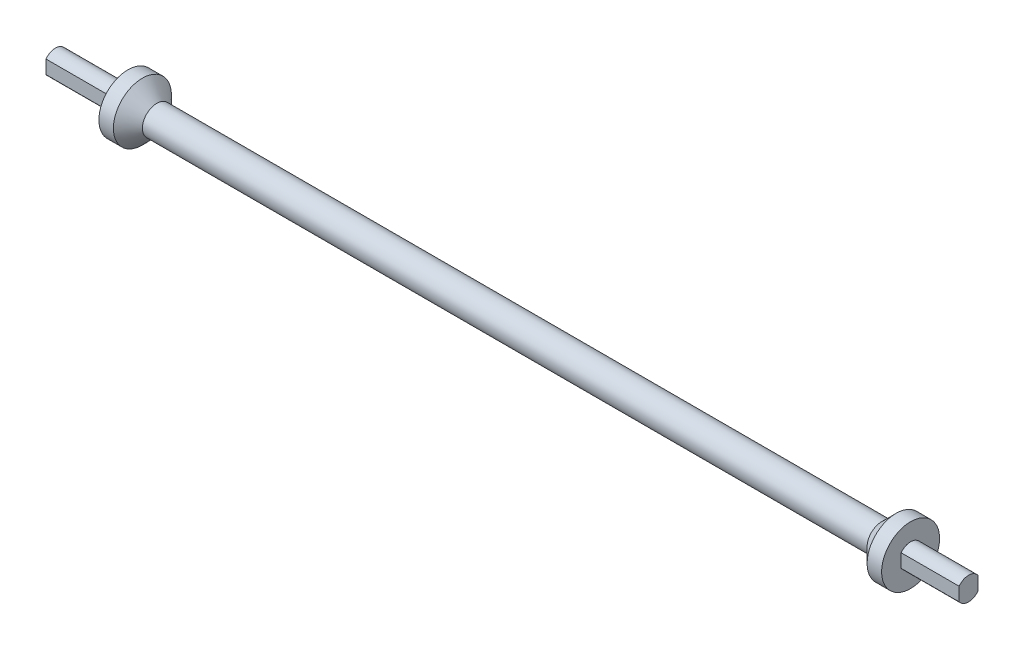
ISO-10303-21;
HEADER;
FILE_DESCRIPTION(('STEP AP214'),'2;1');
FILE_NAME('part.step','',(''),(''),'','','');
FILE_SCHEMA(('AUTOMOTIVE_DESIGN { 1 0 10303 214 1 1 1 1 }'));
ENDSEC;
DATA;
#1=APPLICATION_CONTEXT('core data for automotive mechanical design processes');
#2=APPLICATION_PROTOCOL_DEFINITION('international standard','automotive_design',2000,#1);
#3=PRODUCT_CONTEXT('',#1,'mechanical');
#4=PRODUCT('Part','Part','',(#3));
#5=PRODUCT_RELATED_PRODUCT_CATEGORY('part','',(#4));
#6=PRODUCT_DEFINITION_FORMATION('','',#4);
#7=PRODUCT_DEFINITION_CONTEXT('part definition',#1,'design');
#8=PRODUCT_DEFINITION('design','',#6,#7);
#9=PRODUCT_DEFINITION_SHAPE('','',#8);
#10=(LENGTH_UNIT() NAMED_UNIT(*) SI_UNIT(.MILLI.,.METRE.));
#11=(NAMED_UNIT(*) PLANE_ANGLE_UNIT() SI_UNIT($,.RADIAN.));
#12=(NAMED_UNIT(*) SI_UNIT($,.STERADIAN.) SOLID_ANGLE_UNIT());
#13=UNCERTAINTY_MEASURE_WITH_UNIT(LENGTH_MEASURE(1.E-05),#10,'distance_accuracy_value','');
#14=(GEOMETRIC_REPRESENTATION_CONTEXT(3) GLOBAL_UNCERTAINTY_ASSIGNED_CONTEXT((#13)) GLOBAL_UNIT_ASSIGNED_CONTEXT((#10,
#11,#12)) REPRESENTATION_CONTEXT('',''));
#15=CARTESIAN_POINT('',(0.,0.,0.));
#16=DIRECTION('',(0.,0.,1.));
#17=DIRECTION('',(1.,0.,0.));
#18=AXIS2_PLACEMENT_3D('',#15,#16,#17);
#19=CARTESIAN_POINT('',(-25.3674142888742,0.,0.));
#20=DIRECTION('',(-1.,0.,0.));
#21=DIRECTION('',(0.,0.,1.));
#22=AXIS2_PLACEMENT_3D('',#19,#20,#21);
#23=CYLINDRICAL_SURFACE('',#22,3.99999999999996);
#24=DIRECTION('',(-1.,0.,0.));
#25=VECTOR('',#24,1.);
#26=CARTESIAN_POINT('',(-25.3674142888742,2.33184476327214,3.25));
#27=LINE('',#26,#25);
#28=CARTESIAN_POINT('',(-135.,2.33184476327215,3.25));
#29=VERTEX_POINT('',#28);
#30=CARTESIAN_POINT('',(-160.,2.33184476327214,3.25));
#31=VERTEX_POINT('',#30);
#32=EDGE_CURVE('E49',#29,#31,#27,.T.);
#33=ORIENTED_EDGE('',*,*,#32,.F.);
#34=CARTESIAN_POINT('',(-135.,0.,0.));
#35=DIRECTION('',(-1.,0.,0.));
#36=DIRECTION('',(0.,0.,1.));
#37=AXIS2_PLACEMENT_3D('',#34,#35,#36);
#38=CIRCLE('',#37,3.99999999999997);
#39=CARTESIAN_POINT('',(-135.,2.33184476327214,-3.25));
#40=VERTEX_POINT('',#39);
#41=EDGE_CURVE('E111',#29,#40,#38,.T.);
#42=ORIENTED_EDGE('',*,*,#41,.T.);
#43=DIRECTION('',(-1.,0.,0.));
#44=VECTOR('',#43,1.);
#45=CARTESIAN_POINT('',(-25.3674142888742,2.33184476327214,-3.25));
#46=LINE('',#45,#44);
#47=CARTESIAN_POINT('',(-160.,2.33184476327214,-3.25));
#48=VERTEX_POINT('',#47);
#49=EDGE_CURVE('E187',#48,#40,#46,.F.);
#50=ORIENTED_EDGE('',*,*,#49,.F.);
#51=CARTESIAN_POINT('',(-160.,0.,0.));
#52=DIRECTION('',(1.,0.,0.));
#53=DIRECTION('',(0.,0.,-1.));
#54=AXIS2_PLACEMENT_3D('',#51,#52,#53);
#55=CIRCLE('',#54,3.99999999999996);
#56=EDGE_CURVE('E114',#48,#31,#55,.T.);
#57=ORIENTED_EDGE('',*,*,#56,.T.);
#58=EDGE_LOOP('',(#33,#42,#50,#57));
#59=FACE_BOUND('',#58,.T.);
#60=ADVANCED_FACE('F34',(#59),#23,.T.);
#61=DIRECTION('',(-1.,0.,0.));
#62=VECTOR('',#61,1.);
#63=CARTESIAN_POINT('',(-25.3674142888742,-2.33184476327214,3.25));
#64=LINE('',#63,#62);
#65=CARTESIAN_POINT('',(-160.,-2.33184476327214,3.25));
#66=VERTEX_POINT('',#65);
#67=CARTESIAN_POINT('',(-135.,-2.33184476327215,3.25));
#68=VERTEX_POINT('',#67);
#69=EDGE_CURVE('E101',#66,#68,#64,.F.);
#70=ORIENTED_EDGE('',*,*,#69,.F.);
#71=CARTESIAN_POINT('',(-160.,-2.33184476327214,-3.25));
#72=VERTEX_POINT('',#71);
#73=EDGE_CURVE('E153',#66,#72,#55,.T.);
#74=ORIENTED_EDGE('',*,*,#73,.T.);
#75=DIRECTION('',(-1.,0.,0.));
#76=VECTOR('',#75,1.);
#77=CARTESIAN_POINT('',(-25.3674142888742,-2.33184476327214,-3.25));
#78=LINE('',#77,#76);
#79=CARTESIAN_POINT('',(-135.,-2.33184476327214,-3.25));
#80=VERTEX_POINT('',#79);
#81=EDGE_CURVE('E188',#80,#72,#78,.T.);
#82=ORIENTED_EDGE('',*,*,#81,.F.);
#83=EDGE_CURVE('E121',#80,#68,#38,.T.);
#84=ORIENTED_EDGE('',*,*,#83,.T.);
#85=EDGE_LOOP('',(#70,#74,#82,#84));
#86=FACE_BOUND('',#85,.T.);
#87=ADVANCED_FACE('F195',(#86),#23,.T.);
#88=CARTESIAN_POINT('',(-160.,10.,0.));
#89=DIRECTION('',(1.,0.,0.));
#90=DIRECTION('',(0.,0.,-1.));
#91=AXIS2_PLACEMENT_3D('',#88,#89,#90);
#92=PLANE('',#91);
#93=DIRECTION('',(0.,-1.,0.));
#94=VECTOR('',#93,1.);
#95=CARTESIAN_POINT('',(-160.,10.0000000000001,3.25));
#96=LINE('',#95,#94);
#97=EDGE_CURVE('E106',#31,#66,#96,.T.);
#98=ORIENTED_EDGE('',*,*,#97,.F.);
#99=ORIENTED_EDGE('',*,*,#56,.F.);
#100=DIRECTION('',(0.,1.,0.));
#101=VECTOR('',#100,1.);
#102=CARTESIAN_POINT('',(-160.,10.,-3.25));
#103=LINE('',#102,#101);
#104=EDGE_CURVE('E12',#72,#48,#103,.T.);
#105=ORIENTED_EDGE('',*,*,#104,.F.);
#106=ORIENTED_EDGE('',*,*,#73,.F.);
#107=EDGE_LOOP('',(#98,#99,#105,#106));
#108=FACE_BOUND('',#107,.T.);
#109=ADVANCED_FACE('F197',(#108),#92,.F.);
#110=CARTESIAN_POINT('',(155.,4.,0.));
#111=DIRECTION('',(-1.,0.,0.));
#112=DIRECTION('',(0.,0.,1.));
#113=AXIS2_PLACEMENT_3D('',#110,#111,#112);
#114=PLANE('',#113);
#115=DIRECTION('',(0.,-1.,0.));
#116=VECTOR('',#115,1.);
#117=CARTESIAN_POINT('',(155.,10.0000000000001,3.25));
#118=LINE('',#117,#116);
#119=CARTESIAN_POINT('',(155.,2.33184476327221,3.25));
#120=VERTEX_POINT('',#119);
#121=CARTESIAN_POINT('',(155.,-2.33184476327221,3.25));
#122=VERTEX_POINT('',#121);
#123=EDGE_CURVE('E294',#120,#122,#118,.T.);
#124=ORIENTED_EDGE('',*,*,#123,.T.);
#125=CARTESIAN_POINT('',(155.,0.,0.));
#126=DIRECTION('',(-1.,0.,0.));
#127=DIRECTION('',(0.,0.,1.));
#128=AXIS2_PLACEMENT_3D('',#125,#126,#127);
#129=CIRCLE('',#128,4.);
#130=CARTESIAN_POINT('',(155.,-2.3318447632722,-3.25));
#131=VERTEX_POINT('',#130);
#132=EDGE_CURVE('E122',#131,#122,#129,.T.);
#133=ORIENTED_EDGE('',*,*,#132,.F.);
#134=DIRECTION('',(0.,-1.,0.));
#135=VECTOR('',#134,1.);
#136=CARTESIAN_POINT('',(155.,10.0000000000001,-3.25));
#137=LINE('',#136,#135);
#138=CARTESIAN_POINT('',(155.,2.3318447632722,-3.25));
#139=VERTEX_POINT('',#138);
#140=EDGE_CURVE('E172',#139,#131,#137,.T.);
#141=ORIENTED_EDGE('',*,*,#140,.F.);
#142=EDGE_CURVE('E126',#120,#139,#129,.T.);
#143=ORIENTED_EDGE('',*,*,#142,.F.);
#144=EDGE_LOOP('',(#124,#133,#141,#143));
#145=FACE_BOUND('',#144,.T.);
#146=ADVANCED_FACE('F178',(#145),#114,.F.);
#147=CARTESIAN_POINT('',(-25.3674142888742,0.,0.));
#148=DIRECTION('',(-1.,0.,0.));
#149=DIRECTION('',(0.,0.,1.));
#150=AXIS2_PLACEMENT_3D('',#147,#148,#149);
#151=CYLINDRICAL_SURFACE('',#150,4.);
#152=DIRECTION('',(-1.,0.,0.));
#153=VECTOR('',#152,1.);
#154=CARTESIAN_POINT('',(-25.3674142888742,2.33184476327221,3.25));
#155=LINE('',#154,#153);
#156=CARTESIAN_POINT('',(135.,2.3318447632722,3.25));
#157=VERTEX_POINT('',#156);
#158=EDGE_CURVE('E166',#120,#157,#155,.T.);
#159=ORIENTED_EDGE('',*,*,#158,.F.);
#160=ORIENTED_EDGE('',*,*,#142,.T.);
#161=DIRECTION('',(-1.,0.,0.));
#162=VECTOR('',#161,1.);
#163=CARTESIAN_POINT('',(-25.3674142888742,2.33184476327221,-3.25));
#164=LINE('',#163,#162);
#165=CARTESIAN_POINT('',(135.,2.3318447632722,-3.25));
#166=VERTEX_POINT('',#165);
#167=EDGE_CURVE('E165',#166,#139,#164,.F.);
#168=ORIENTED_EDGE('',*,*,#167,.F.);
#169=CARTESIAN_POINT('',(135.,0.,0.));
#170=DIRECTION('',(-1.,0.,0.));
#171=DIRECTION('',(0.,0.,1.));
#172=AXIS2_PLACEMENT_3D('',#169,#170,#171);
#173=CIRCLE('',#172,4.);
#174=EDGE_CURVE('E57',#157,#166,#173,.T.);
#175=ORIENTED_EDGE('',*,*,#174,.F.);
#176=EDGE_LOOP('',(#159,#160,#168,#175));
#177=FACE_BOUND('',#176,.T.);
#178=ADVANCED_FACE('F164',(#177),#151,.T.);
#179=DIRECTION('',(-1.,0.,0.));
#180=VECTOR('',#179,1.);
#181=CARTESIAN_POINT('',(-25.3674142888742,-2.33184476327221,3.25));
#182=LINE('',#181,#180);
#183=CARTESIAN_POINT('',(135.,-2.33184476327221,3.25));
#184=VERTEX_POINT('',#183);
#185=EDGE_CURVE('E181',#184,#122,#182,.F.);
#186=ORIENTED_EDGE('',*,*,#185,.F.);
#187=CARTESIAN_POINT('',(135.,-2.33184476327221,-3.25));
#188=VERTEX_POINT('',#187);
#189=EDGE_CURVE('E156',#188,#184,#173,.T.);
#190=ORIENTED_EDGE('',*,*,#189,.F.);
#191=DIRECTION('',(-1.,0.,0.));
#192=VECTOR('',#191,1.);
#193=CARTESIAN_POINT('',(-25.3674142888742,-2.33184476327221,-3.25));
#194=LINE('',#193,#192);
#195=EDGE_CURVE('E175',#131,#188,#194,.T.);
#196=ORIENTED_EDGE('',*,*,#195,.F.);
#197=ORIENTED_EDGE('',*,*,#132,.T.);
#198=EDGE_LOOP('',(#186,#190,#196,#197));
#199=FACE_BOUND('',#198,.T.);
#200=ADVANCED_FACE('F144',(#199),#151,.T.);
#201=CARTESIAN_POINT('',(130.,0.,0.));
#202=DIRECTION('',(1.,0.,0.));
#203=DIRECTION('',(0.,0.,-1.));
#204=AXIS2_PLACEMENT_3D('',#201,#202,#203);
#205=CONICAL_SURFACE('',#204,10.0000000000001,0.785398163397449);
#206=CARTESIAN_POINT('',(125.,0.,0.));
#207=DIRECTION('',(-1.,0.,0.));
#208=DIRECTION('',(0.,0.,1.));
#209=AXIS2_PLACEMENT_3D('',#206,#207,#208);
#210=CIRCLE('',#209,4.99999999999997);
#211=CARTESIAN_POINT('',(125.,0.,4.99999999999997));
#212=VERTEX_POINT('',#211);
#213=EDGE_CURVE('E42',#212,#212,#210,.T.);
#214=ORIENTED_EDGE('',*,*,#213,.F.);
#215=EDGE_LOOP('',(#214));
#216=FACE_BOUND('',#215,.T.);
#217=CARTESIAN_POINT('',(130.,0.,0.));
#218=DIRECTION('',(-1.,0.,0.));
#219=DIRECTION('',(0.,0.,1.));
#220=AXIS2_PLACEMENT_3D('',#217,#218,#219);
#221=CIRCLE('',#220,10.0000000000001);
#222=CARTESIAN_POINT('',(130.,0.,10.0000000000001));
#223=VERTEX_POINT('',#222);
#224=EDGE_CURVE('E147',#223,#223,#221,.T.);
#225=ORIENTED_EDGE('',*,*,#224,.T.);
#226=EDGE_LOOP('',(#225));
#227=FACE_BOUND('',#226,.T.);
#228=ADVANCED_FACE('F36',(#216,#227),#205,.T.);
#229=CARTESIAN_POINT('',(-25.3674142888742,0.,0.));
#230=DIRECTION('',(-1.,0.,0.));
#231=DIRECTION('',(0.,0.,1.));
#232=AXIS2_PLACEMENT_3D('',#229,#230,#231);
#233=CYLINDRICAL_SURFACE('',#232,4.99999999999995);
#234=CARTESIAN_POINT('',(-125.,0.,0.));
#235=DIRECTION('',(-1.,0.,0.));
#236=DIRECTION('',(0.,0.,1.));
#237=AXIS2_PLACEMENT_3D('',#234,#235,#236);
#238=CIRCLE('',#237,4.99999999999994);
#239=CARTESIAN_POINT('',(-125.,0.,4.99999999999994));
#240=VERTEX_POINT('',#239);
#241=EDGE_CURVE('E135',#240,#240,#238,.T.);
#242=ORIENTED_EDGE('',*,*,#241,.F.);
#243=EDGE_LOOP('',(#242));
#244=FACE_BOUND('',#243,.T.);
#245=ORIENTED_EDGE('',*,*,#213,.T.);
#246=EDGE_LOOP('',(#245));
#247=FACE_BOUND('',#246,.T.);
#248=ADVANCED_FACE('F140',(#244,#247),#233,.T.);
#249=CARTESIAN_POINT('',(-125.,0.,0.));
#250=DIRECTION('',(-1.,0.,0.));
#251=DIRECTION('',(0.,0.,1.));
#252=AXIS2_PLACEMENT_3D('',#249,#250,#251);
#253=CONICAL_SURFACE('',#252,4.99999999999994,0.785398163397445);
#254=CARTESIAN_POINT('',(-130.,0.,0.));
#255=DIRECTION('',(-1.,0.,0.));
#256=DIRECTION('',(0.,0.,1.));
#257=AXIS2_PLACEMENT_3D('',#254,#255,#256);
#258=CIRCLE('',#257,10.);
#259=CARTESIAN_POINT('',(-130.,0.,10.));
#260=VERTEX_POINT('',#259);
#261=EDGE_CURVE('E132',#260,#260,#258,.T.);
#262=ORIENTED_EDGE('',*,*,#261,.F.);
#263=EDGE_LOOP('',(#262));
#264=FACE_BOUND('',#263,.T.);
#265=ORIENTED_EDGE('',*,*,#241,.T.);
#266=EDGE_LOOP('',(#265));
#267=FACE_BOUND('',#266,.T.);
#268=ADVANCED_FACE('F224',(#264,#267),#253,.T.);
#269=CARTESIAN_POINT('',(-25.3674142888742,0.,0.));
#270=DIRECTION('',(-1.,0.,0.));
#271=DIRECTION('',(0.,0.,1.));
#272=AXIS2_PLACEMENT_3D('',#269,#270,#271);
#273=CYLINDRICAL_SURFACE('',#272,10.);
#274=CARTESIAN_POINT('',(-135.,0.,0.));
#275=DIRECTION('',(-1.,0.,0.));
#276=DIRECTION('',(0.,0.,1.));
#277=AXIS2_PLACEMENT_3D('',#274,#275,#276);
#278=CIRCLE('',#277,10.);
#279=CARTESIAN_POINT('',(-135.,0.,10.));
#280=VERTEX_POINT('',#279);
#281=EDGE_CURVE('E124',#280,#280,#278,.T.);
#282=ORIENTED_EDGE('',*,*,#281,.F.);
#283=EDGE_LOOP('',(#282));
#284=FACE_BOUND('',#283,.T.);
#285=ORIENTED_EDGE('',*,*,#261,.T.);
#286=EDGE_LOOP('',(#285));
#287=FACE_BOUND('',#286,.T.);
#288=ADVANCED_FACE('F221',(#284,#287),#273,.T.);
#289=CARTESIAN_POINT('',(-135.,10.,0.));
#290=DIRECTION('',(1.,0.,0.));
#291=DIRECTION('',(0.,0.,-1.));
#292=AXIS2_PLACEMENT_3D('',#289,#290,#291);
#293=PLANE('',#292);
#294=ORIENTED_EDGE('',*,*,#41,.F.);
#295=DIRECTION('',(0.,-1.,0.));
#296=VECTOR('',#295,1.);
#297=CARTESIAN_POINT('',(-135.,10.0000000000001,3.25));
#298=LINE('',#297,#296);
#299=EDGE_CURVE('E98',#29,#68,#298,.T.);
#300=ORIENTED_EDGE('',*,*,#299,.T.);
#301=ORIENTED_EDGE('',*,*,#83,.F.);
#302=DIRECTION('',(0.,-1.,0.));
#303=VECTOR('',#302,1.);
#304=CARTESIAN_POINT('',(-135.,10.0000000000001,-3.25));
#305=LINE('',#304,#303);
#306=EDGE_CURVE('E120',#40,#80,#305,.T.);
#307=ORIENTED_EDGE('',*,*,#306,.F.);
#308=EDGE_LOOP('',(#294,#300,#301,#307));
#309=FACE_BOUND('',#308,.T.);
#310=ORIENTED_EDGE('',*,*,#281,.T.);
#311=EDGE_LOOP('',(#310));
#312=FACE_BOUND('',#311,.T.);
#313=ADVANCED_FACE('F118',(#309,#312),#293,.F.);
#314=CARTESIAN_POINT('',(135.,10.0000000000001,0.));
#315=DIRECTION('',(-1.,0.,0.));
#316=DIRECTION('',(0.,0.,1.));
#317=AXIS2_PLACEMENT_3D('',#314,#315,#316);
#318=PLANE('',#317);
#319=ORIENTED_EDGE('',*,*,#189,.T.);
#320=DIRECTION('',(0.,-1.,0.));
#321=VECTOR('',#320,1.);
#322=CARTESIAN_POINT('',(135.,10.0000000000001,3.25));
#323=LINE('',#322,#321);
#324=EDGE_CURVE('E115',#157,#184,#323,.T.);
#325=ORIENTED_EDGE('',*,*,#324,.F.);
#326=ORIENTED_EDGE('',*,*,#174,.T.);
#327=DIRECTION('',(0.,-1.,0.));
#328=VECTOR('',#327,1.);
#329=CARTESIAN_POINT('',(135.,10.0000000000001,-3.25));
#330=LINE('',#329,#328);
#331=EDGE_CURVE('E174',#166,#188,#330,.T.);
#332=ORIENTED_EDGE('',*,*,#331,.T.);
#333=EDGE_LOOP('',(#319,#325,#326,#332));
#334=FACE_BOUND('',#333,.T.);
#335=CARTESIAN_POINT('',(135.,0.,0.));
#336=DIRECTION('',(-1.,0.,0.));
#337=DIRECTION('',(0.,0.,1.));
#338=AXIS2_PLACEMENT_3D('',#335,#336,#337);
#339=CIRCLE('',#338,10.0000000000001);
#340=CARTESIAN_POINT('',(135.,0.,10.0000000000001));
#341=VERTEX_POINT('',#340);
#342=EDGE_CURVE('E149',#341,#341,#339,.T.);
#343=ORIENTED_EDGE('',*,*,#342,.F.);
#344=EDGE_LOOP('',(#343));
#345=FACE_BOUND('',#344,.T.);
#346=ADVANCED_FACE('F208',(#334,#345),#318,.F.);
#347=CARTESIAN_POINT('',(-25.3674142888742,0.,0.));
#348=DIRECTION('',(-1.,0.,0.));
#349=DIRECTION('',(0.,0.,1.));
#350=AXIS2_PLACEMENT_3D('',#347,#348,#349);
#351=CYLINDRICAL_SURFACE('',#350,10.0000000000001);
#352=ORIENTED_EDGE('',*,*,#224,.F.);
#353=EDGE_LOOP('',(#352));
#354=FACE_BOUND('',#353,.T.);
#355=ORIENTED_EDGE('',*,*,#342,.T.);
#356=EDGE_LOOP('',(#355));
#357=FACE_BOUND('',#356,.T.);
#358=ADVANCED_FACE('F200',(#354,#357),#351,.T.);
#359=CARTESIAN_POINT('',(-160.,10.0000000000001,-3.25));
#360=DIRECTION('',(0.,0.,-1.));
#361=DIRECTION('',(-1.,0.,0.));
#362=AXIS2_PLACEMENT_3D('',#359,#360,#361);
#363=PLANE('',#362);
#364=ORIENTED_EDGE('',*,*,#81,.T.);
#365=ORIENTED_EDGE('',*,*,#104,.T.);
#366=ORIENTED_EDGE('',*,*,#49,.T.);
#367=ORIENTED_EDGE('',*,*,#306,.T.);
#368=EDGE_LOOP('',(#364,#365,#366,#367));
#369=FACE_BOUND('',#368,.T.);
#370=ADVANCED_FACE('F198',(#369),#363,.T.);
#371=CARTESIAN_POINT('',(135.,10.0000000000001,-3.25));
#372=DIRECTION('',(0.,0.,-1.));
#373=DIRECTION('',(-1.,0.,0.));
#374=AXIS2_PLACEMENT_3D('',#371,#372,#373);
#375=PLANE('',#374);
#376=ORIENTED_EDGE('',*,*,#195,.T.);
#377=ORIENTED_EDGE('',*,*,#331,.F.);
#378=ORIENTED_EDGE('',*,*,#167,.T.);
#379=ORIENTED_EDGE('',*,*,#140,.T.);
#380=EDGE_LOOP('',(#376,#377,#378,#379));
#381=FACE_BOUND('',#380,.T.);
#382=ADVANCED_FACE('F171',(#381),#375,.T.);
#383=CARTESIAN_POINT('',(135.,10.0000000000001,3.25));
#384=DIRECTION('',(0.,0.,1.));
#385=DIRECTION('',(1.,0.,0.));
#386=AXIS2_PLACEMENT_3D('',#383,#384,#385);
#387=PLANE('',#386);
#388=ORIENTED_EDGE('',*,*,#158,.T.);
#389=ORIENTED_EDGE('',*,*,#324,.T.);
#390=ORIENTED_EDGE('',*,*,#185,.T.);
#391=ORIENTED_EDGE('',*,*,#123,.F.);
#392=EDGE_LOOP('',(#388,#389,#390,#391));
#393=FACE_BOUND('',#392,.T.);
#394=ADVANCED_FACE('F206',(#393),#387,.T.);
#395=CARTESIAN_POINT('',(-160.,10.0000000000001,3.25));
#396=DIRECTION('',(0.,0.,1.));
#397=DIRECTION('',(1.,0.,0.));
#398=AXIS2_PLACEMENT_3D('',#395,#396,#397);
#399=PLANE('',#398);
#400=ORIENTED_EDGE('',*,*,#32,.T.);
#401=ORIENTED_EDGE('',*,*,#97,.T.);
#402=ORIENTED_EDGE('',*,*,#69,.T.);
#403=ORIENTED_EDGE('',*,*,#299,.F.);
#404=EDGE_LOOP('',(#400,#401,#402,#403));
#405=FACE_BOUND('',#404,.T.);
#406=ADVANCED_FACE('F99',(#405),#399,.T.);
#407=CLOSED_SHELL('',(#60,#87,#109,#146,#178,#200,#228,#248,#268,#288,#313,#346,#358,#370,#382,
#394,#406));
#408=MANIFOLD_SOLID_BREP('B2',#407);
#409=ADVANCED_BREP_SHAPE_REPRESENTATION('',(#18,#408),#14);
#410=SHAPE_DEFINITION_REPRESENTATION(#9,#409);
ENDSEC;
END-ISO-10303-21;
